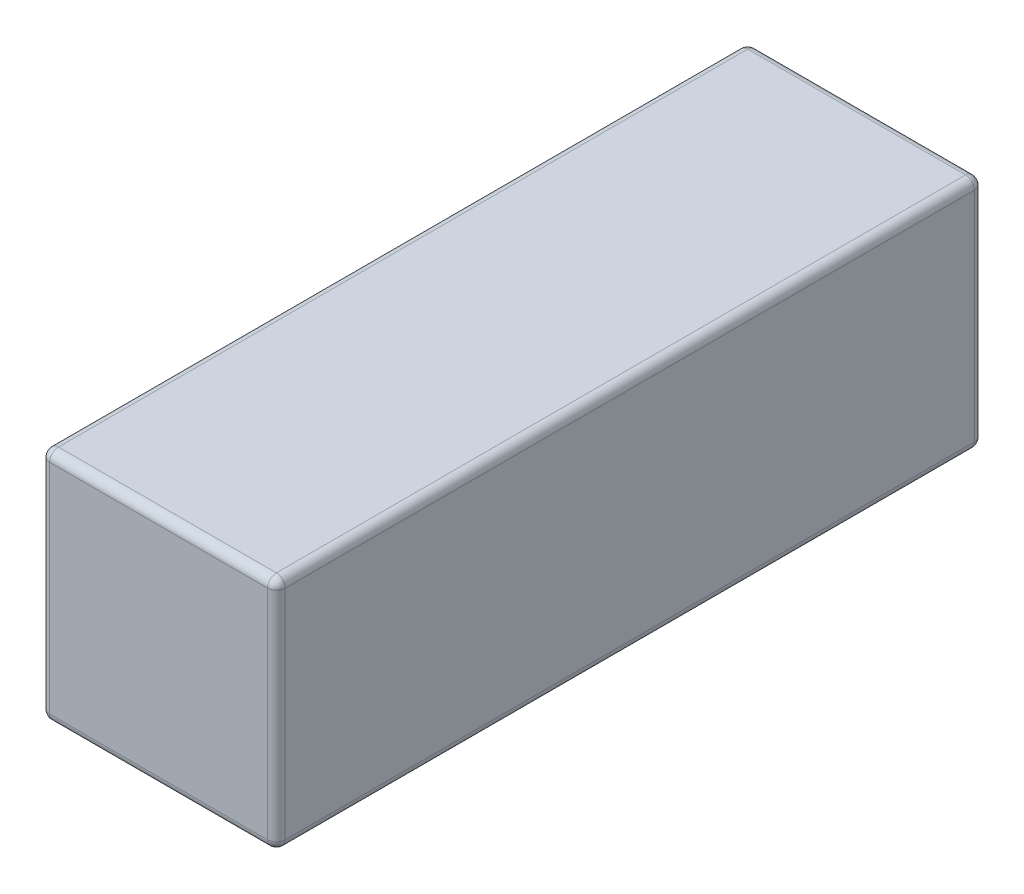
ISO-10303-21;
HEADER;
FILE_DESCRIPTION(('STEP AP214'),'2;1');
FILE_NAME('part.step','',(''),(''),'','','');
FILE_SCHEMA(('AUTOMOTIVE_DESIGN { 1 0 10303 214 1 1 1 1 }'));
ENDSEC;
DATA;
#1=APPLICATION_CONTEXT('core data for automotive mechanical design processes');
#2=APPLICATION_PROTOCOL_DEFINITION('international standard','automotive_design',2000,#1);
#3=PRODUCT_CONTEXT('',#1,'mechanical');
#4=PRODUCT('Part','Part','',(#3));
#5=PRODUCT_RELATED_PRODUCT_CATEGORY('part','',(#4));
#6=PRODUCT_DEFINITION_FORMATION('','',#4);
#7=PRODUCT_DEFINITION_CONTEXT('part definition',#1,'design');
#8=PRODUCT_DEFINITION('design','',#6,#7);
#9=PRODUCT_DEFINITION_SHAPE('','',#8);
#10=(LENGTH_UNIT() NAMED_UNIT(*) SI_UNIT(.MILLI.,.METRE.));
#11=(NAMED_UNIT(*) PLANE_ANGLE_UNIT() SI_UNIT($,.RADIAN.));
#12=(NAMED_UNIT(*) SI_UNIT($,.STERADIAN.) SOLID_ANGLE_UNIT());
#13=UNCERTAINTY_MEASURE_WITH_UNIT(LENGTH_MEASURE(1.E-05),#10,'distance_accuracy_value','');
#14=(GEOMETRIC_REPRESENTATION_CONTEXT(3) GLOBAL_UNCERTAINTY_ASSIGNED_CONTEXT((#13)) GLOBAL_UNIT_ASSIGNED_CONTEXT((#10,
#11,#12)) REPRESENTATION_CONTEXT('',''));
#15=CARTESIAN_POINT('',(0.,0.,0.));
#16=DIRECTION('',(0.,0.,1.));
#17=DIRECTION('',(1.,0.,0.));
#18=AXIS2_PLACEMENT_3D('',#15,#16,#17);
#19=CARTESIAN_POINT('',(2.,-2.,6.));
#20=DIRECTION('',(0.,1.,0.));
#21=DIRECTION('',(-1.,0.,0.));
#22=AXIS2_PLACEMENT_3D('',#19,#20,#21);
#23=PLANE('',#22);
#24=DIRECTION('',(1.,0.,0.));
#25=VECTOR('',#24,1.);
#26=CARTESIAN_POINT('',(2.,-2.,5.85));
#27=LINE('',#26,#25);
#28=CARTESIAN_POINT('',(1.85,-2.,5.85));
#29=VERTEX_POINT('',#28);
#30=CARTESIAN_POINT('',(-1.85,-2.,5.85));
#31=VERTEX_POINT('',#30);
#32=EDGE_CURVE('E133',#29,#31,#27,.F.);
#33=ORIENTED_EDGE('',*,*,#32,.T.);
#34=DIRECTION('',(0.,0.,-1.));
#35=VECTOR('',#34,1.);
#36=CARTESIAN_POINT('',(-1.85,-2.,6.));
#37=LINE('',#36,#35);
#38=CARTESIAN_POINT('',(-1.85,-2.,-5.85));
#39=VERTEX_POINT('',#38);
#40=EDGE_CURVE('E169',#31,#39,#37,.T.);
#41=ORIENTED_EDGE('',*,*,#40,.T.);
#42=DIRECTION('',(1.,0.,0.));
#43=VECTOR('',#42,1.);
#44=CARTESIAN_POINT('',(2.,-2.,-5.85));
#45=LINE('',#44,#43);
#46=CARTESIAN_POINT('',(1.85,-2.,-5.85));
#47=VERTEX_POINT('',#46);
#48=EDGE_CURVE('E136',#39,#47,#45,.T.);
#49=ORIENTED_EDGE('',*,*,#48,.T.);
#50=DIRECTION('',(0.,0.,-1.));
#51=VECTOR('',#50,1.);
#52=CARTESIAN_POINT('',(1.85,-2.,6.));
#53=LINE('',#52,#51);
#54=EDGE_CURVE('E129',#47,#29,#53,.F.);
#55=ORIENTED_EDGE('',*,*,#54,.T.);
#56=EDGE_LOOP('',(#33,#41,#49,#55));
#57=FACE_BOUND('',#56,.T.);
#58=ADVANCED_FACE('F41',(#57),#23,.F.);
#59=CARTESIAN_POINT('',(2.,-2.,6.));
#60=DIRECTION('',(-1.,0.,0.));
#61=DIRECTION('',(0.,0.,1.));
#62=AXIS2_PLACEMENT_3D('',#59,#60,#61);
#63=PLANE('',#62);
#64=DIRECTION('',(0.,1.,0.));
#65=VECTOR('',#64,1.);
#66=CARTESIAN_POINT('',(2.,2.,-5.85));
#67=LINE('',#66,#65);
#68=CARTESIAN_POINT('',(2.,-1.85,-5.85));
#69=VERTEX_POINT('',#68);
#70=CARTESIAN_POINT('',(2.,1.85,-5.85));
#71=VERTEX_POINT('',#70);
#72=EDGE_CURVE('E201',#69,#71,#67,.T.);
#73=ORIENTED_EDGE('',*,*,#72,.T.);
#74=DIRECTION('',(0.,0.,-1.));
#75=VECTOR('',#74,1.);
#76=CARTESIAN_POINT('',(2.,1.85,6.));
#77=LINE('',#76,#75);
#78=CARTESIAN_POINT('',(2.,1.85,5.85));
#79=VERTEX_POINT('',#78);
#80=EDGE_CURVE('E203',#71,#79,#77,.F.);
#81=ORIENTED_EDGE('',*,*,#80,.T.);
#82=DIRECTION('',(0.,1.,0.));
#83=VECTOR('',#82,1.);
#84=CARTESIAN_POINT('',(2.,-2.,5.85));
#85=LINE('',#84,#83);
#86=CARTESIAN_POINT('',(2.,-1.85,5.85));
#87=VERTEX_POINT('',#86);
#88=EDGE_CURVE('E198',#79,#87,#85,.F.);
#89=ORIENTED_EDGE('',*,*,#88,.T.);
#90=DIRECTION('',(0.,0.,-1.));
#91=VECTOR('',#90,1.);
#92=CARTESIAN_POINT('',(2.,-1.85,6.));
#93=LINE('',#92,#91);
#94=EDGE_CURVE('E146',#87,#69,#93,.T.);
#95=ORIENTED_EDGE('',*,*,#94,.T.);
#96=EDGE_LOOP('',(#73,#81,#89,#95));
#97=FACE_BOUND('',#96,.T.);
#98=ADVANCED_FACE('F302',(#97),#63,.F.);
#99=CARTESIAN_POINT('',(2.,2.,6.));
#100=DIRECTION('',(0.,-1.,0.));
#101=DIRECTION('',(1.,0.,0.));
#102=AXIS2_PLACEMENT_3D('',#99,#100,#101);
#103=PLANE('',#102);
#104=DIRECTION('',(-1.,0.,0.));
#105=VECTOR('',#104,1.);
#106=CARTESIAN_POINT('',(-2.,2.,-5.85));
#107=LINE('',#106,#105);
#108=CARTESIAN_POINT('',(1.85,2.,-5.85));
#109=VERTEX_POINT('',#108);
#110=CARTESIAN_POINT('',(-1.85,2.,-5.85));
#111=VERTEX_POINT('',#110);
#112=EDGE_CURVE('E193',#109,#111,#107,.T.);
#113=ORIENTED_EDGE('',*,*,#112,.T.);
#114=DIRECTION('',(0.,0.,-1.));
#115=VECTOR('',#114,1.);
#116=CARTESIAN_POINT('',(-1.85,2.,6.));
#117=LINE('',#116,#115);
#118=CARTESIAN_POINT('',(-1.85,2.,5.85));
#119=VERTEX_POINT('',#118);
#120=EDGE_CURVE('E195',#111,#119,#117,.F.);
#121=ORIENTED_EDGE('',*,*,#120,.T.);
#122=DIRECTION('',(-1.,0.,0.));
#123=VECTOR('',#122,1.);
#124=CARTESIAN_POINT('',(2.,2.,5.85));
#125=LINE('',#124,#123);
#126=CARTESIAN_POINT('',(1.85,2.,5.85));
#127=VERTEX_POINT('',#126);
#128=EDGE_CURVE('E189',#119,#127,#125,.F.);
#129=ORIENTED_EDGE('',*,*,#128,.T.);
#130=DIRECTION('',(0.,0.,-1.));
#131=VECTOR('',#130,1.);
#132=CARTESIAN_POINT('',(1.85,2.,6.));
#133=LINE('',#132,#131);
#134=EDGE_CURVE('E191',#127,#109,#133,.T.);
#135=ORIENTED_EDGE('',*,*,#134,.T.);
#136=EDGE_LOOP('',(#113,#121,#129,#135));
#137=FACE_BOUND('',#136,.T.);
#138=ADVANCED_FACE('F282',(#137),#103,.F.);
#139=CARTESIAN_POINT('',(-2.,-2.,6.));
#140=DIRECTION('',(1.,0.,0.));
#141=DIRECTION('',(0.,0.,-1.));
#142=AXIS2_PLACEMENT_3D('',#139,#140,#141);
#143=PLANE('',#142);
#144=DIRECTION('',(0.,-1.,0.));
#145=VECTOR('',#144,1.);
#146=CARTESIAN_POINT('',(-2.,-2.,-5.85));
#147=LINE('',#146,#145);
#148=CARTESIAN_POINT('',(-2.,1.85,-5.85));
#149=VERTEX_POINT('',#148);
#150=CARTESIAN_POINT('',(-2.,-1.85,-5.85));
#151=VERTEX_POINT('',#150);
#152=EDGE_CURVE('E175',#149,#151,#147,.T.);
#153=ORIENTED_EDGE('',*,*,#152,.T.);
#154=DIRECTION('',(0.,0.,-1.));
#155=VECTOR('',#154,1.);
#156=CARTESIAN_POINT('',(-2.,-1.85,6.));
#157=LINE('',#156,#155);
#158=CARTESIAN_POINT('',(-2.,-1.85,5.85));
#159=VERTEX_POINT('',#158);
#160=EDGE_CURVE('E177',#151,#159,#157,.F.);
#161=ORIENTED_EDGE('',*,*,#160,.T.);
#162=DIRECTION('',(0.,-1.,0.));
#163=VECTOR('',#162,1.);
#164=CARTESIAN_POINT('',(-2.,-2.,5.85));
#165=LINE('',#164,#163);
#166=CARTESIAN_POINT('',(-2.,1.85,5.85));
#167=VERTEX_POINT('',#166);
#168=EDGE_CURVE('E171',#159,#167,#165,.F.);
#169=ORIENTED_EDGE('',*,*,#168,.T.);
#170=DIRECTION('',(0.,0.,-1.));
#171=VECTOR('',#170,1.);
#172=CARTESIAN_POINT('',(-2.,1.85,6.));
#173=LINE('',#172,#171);
#174=EDGE_CURVE('E173',#167,#149,#173,.T.);
#175=ORIENTED_EDGE('',*,*,#174,.T.);
#176=EDGE_LOOP('',(#153,#161,#169,#175));
#177=FACE_BOUND('',#176,.T.);
#178=ADVANCED_FACE('F309',(#177),#143,.F.);
#179=CARTESIAN_POINT('',(0.,0.,6.));
#180=DIRECTION('',(0.,0.,-1.));
#181=DIRECTION('',(-1.,0.,0.));
#182=AXIS2_PLACEMENT_3D('',#179,#180,#181);
#183=PLANE('',#182);
#184=DIRECTION('',(-1.,0.,0.));
#185=VECTOR('',#184,1.);
#186=CARTESIAN_POINT('',(0.,1.85,6.));
#187=LINE('',#186,#185);
#188=CARTESIAN_POINT('',(1.85,1.85,6.));
#189=VERTEX_POINT('',#188);
#190=CARTESIAN_POINT('',(-1.85,1.85,6.));
#191=VERTEX_POINT('',#190);
#192=EDGE_CURVE('E50',#189,#191,#187,.T.);
#193=ORIENTED_EDGE('',*,*,#192,.T.);
#194=DIRECTION('',(0.,-1.,0.));
#195=VECTOR('',#194,1.);
#196=CARTESIAN_POINT('',(-1.85,0.,6.));
#197=LINE('',#196,#195);
#198=CARTESIAN_POINT('',(-1.85,-1.85,6.));
#199=VERTEX_POINT('',#198);
#200=EDGE_CURVE('E11',#191,#199,#197,.T.);
#201=ORIENTED_EDGE('',*,*,#200,.T.);
#202=DIRECTION('',(1.,0.,0.));
#203=VECTOR('',#202,1.);
#204=CARTESIAN_POINT('',(0.,-1.85,6.));
#205=LINE('',#204,#203);
#206=CARTESIAN_POINT('',(1.85,-1.85,6.));
#207=VERTEX_POINT('',#206);
#208=EDGE_CURVE('E206',#199,#207,#205,.T.);
#209=ORIENTED_EDGE('',*,*,#208,.T.);
#210=DIRECTION('',(0.,1.,0.));
#211=VECTOR('',#210,1.);
#212=CARTESIAN_POINT('',(1.85,0.,6.));
#213=LINE('',#212,#211);
#214=EDGE_CURVE('E61',#207,#189,#213,.T.);
#215=ORIENTED_EDGE('',*,*,#214,.T.);
#216=EDGE_LOOP('',(#193,#201,#209,#215));
#217=FACE_BOUND('',#216,.T.);
#218=ADVANCED_FACE('F373',(#217),#183,.F.);
#219=CARTESIAN_POINT('',(0.,0.,-6.));
#220=DIRECTION('',(0.,0.,-1.));
#221=DIRECTION('',(-1.,0.,0.));
#222=AXIS2_PLACEMENT_3D('',#219,#220,#221);
#223=PLANE('',#222);
#224=DIRECTION('',(1.,0.,0.));
#225=VECTOR('',#224,1.);
#226=CARTESIAN_POINT('',(-2.,-1.85,-6.));
#227=LINE('',#226,#225);
#228=CARTESIAN_POINT('',(1.85,-1.85,-6.));
#229=VERTEX_POINT('',#228);
#230=CARTESIAN_POINT('',(-1.85,-1.85,-6.));
#231=VERTEX_POINT('',#230);
#232=EDGE_CURVE('E184',#229,#231,#227,.F.);
#233=ORIENTED_EDGE('',*,*,#232,.T.);
#234=DIRECTION('',(0.,-1.,0.));
#235=VECTOR('',#234,1.);
#236=CARTESIAN_POINT('',(-1.85,2.,-6.));
#237=LINE('',#236,#235);
#238=CARTESIAN_POINT('',(-1.85,1.85,-6.));
#239=VERTEX_POINT('',#238);
#240=EDGE_CURVE('E186',#231,#239,#237,.F.);
#241=ORIENTED_EDGE('',*,*,#240,.T.);
#242=DIRECTION('',(-1.,0.,0.));
#243=VECTOR('',#242,1.);
#244=CARTESIAN_POINT('',(2.,1.85,-6.));
#245=LINE('',#244,#243);
#246=CARTESIAN_POINT('',(1.85,1.85,-6.));
#247=VERTEX_POINT('',#246);
#248=EDGE_CURVE('E182',#239,#247,#245,.F.);
#249=ORIENTED_EDGE('',*,*,#248,.T.);
#250=DIRECTION('',(0.,1.,0.));
#251=VECTOR('',#250,1.);
#252=CARTESIAN_POINT('',(1.85,-2.,-6.));
#253=LINE('',#252,#251);
#254=EDGE_CURVE('E180',#247,#229,#253,.F.);
#255=ORIENTED_EDGE('',*,*,#254,.T.);
#256=EDGE_LOOP('',(#233,#241,#249,#255));
#257=FACE_BOUND('',#256,.T.);
#258=ADVANCED_FACE('F273',(#257),#223,.T.);
#259=CARTESIAN_POINT('',(1.85,1.85,6.));
#260=DIRECTION('',(0.,0.,-1.));
#261=DIRECTION('',(-1.,0.,0.));
#262=AXIS2_PLACEMENT_3D('',#259,#260,#261);
#263=CYLINDRICAL_SURFACE('',#262,0.15);
#264=CARTESIAN_POINT('',(1.85,1.85,5.85));
#265=DIRECTION('',(0.,0.,1.));
#266=DIRECTION('',(1.,0.,0.));
#267=AXIS2_PLACEMENT_3D('',#264,#265,#266);
#268=CIRCLE('',#267,0.15);
#269=EDGE_CURVE('E45',#79,#127,#268,.T.);
#270=ORIENTED_EDGE('',*,*,#269,.F.);
#271=ORIENTED_EDGE('',*,*,#80,.F.);
#272=CARTESIAN_POINT('',(1.85,1.85,-5.85));
#273=DIRECTION('',(0.,0.,-1.));
#274=DIRECTION('',(-1.,0.,0.));
#275=AXIS2_PLACEMENT_3D('',#272,#273,#274);
#276=CIRCLE('',#275,0.15);
#277=EDGE_CURVE('E166',#109,#71,#276,.T.);
#278=ORIENTED_EDGE('',*,*,#277,.F.);
#279=ORIENTED_EDGE('',*,*,#134,.F.);
#280=EDGE_LOOP('',(#270,#271,#278,#279));
#281=FACE_BOUND('',#280,.T.);
#282=ADVANCED_FACE('F43',(#281),#263,.T.);
#283=CARTESIAN_POINT('',(1.85,1.85,5.85));
#284=DIRECTION('',(0.,0.,1.));
#285=DIRECTION('',(1.,0.,0.));
#286=AXIS2_PLACEMENT_3D('',#283,#284,#285);
#287=SPHERICAL_SURFACE('',#286,0.15);
#288=CARTESIAN_POINT('',(1.85,1.85,5.85));
#289=DIRECTION('',(0.,1.,0.));
#290=DIRECTION('',(0.,0.,1.));
#291=AXIS2_PLACEMENT_3D('',#288,#289,#290);
#292=CIRCLE('',#291,0.15);
#293=EDGE_CURVE('E252',#79,#189,#292,.F.);
#294=ORIENTED_EDGE('',*,*,#293,.F.);
#295=ORIENTED_EDGE('',*,*,#269,.T.);
#296=CARTESIAN_POINT('',(1.85,1.85,5.85));
#297=DIRECTION('',(1.,0.,0.));
#298=DIRECTION('',(0.,0.,-1.));
#299=AXIS2_PLACEMENT_3D('',#296,#297,#298);
#300=CIRCLE('',#299,0.15);
#301=EDGE_CURVE('E254',#189,#127,#300,.F.);
#302=ORIENTED_EDGE('',*,*,#301,.F.);
#303=EDGE_LOOP('',(#294,#295,#302));
#304=FACE_BOUND('',#303,.T.);
#305=ADVANCED_FACE('F298',(#304),#287,.T.);
#306=CARTESIAN_POINT('',(1.85,1.85,-5.85));
#307=DIRECTION('',(0.,0.,1.));
#308=DIRECTION('',(1.,0.,0.));
#309=AXIS2_PLACEMENT_3D('',#306,#307,#308);
#310=SPHERICAL_SURFACE('',#309,0.15);
#311=CARTESIAN_POINT('',(1.85,1.85,-5.85));
#312=DIRECTION('',(1.,0.,0.));
#313=DIRECTION('',(0.,0.,-1.));
#314=AXIS2_PLACEMENT_3D('',#311,#312,#313);
#315=CIRCLE('',#314,0.15);
#316=EDGE_CURVE('E246',#109,#247,#315,.F.);
#317=ORIENTED_EDGE('',*,*,#316,.F.);
#318=ORIENTED_EDGE('',*,*,#277,.T.);
#319=CARTESIAN_POINT('',(1.85,1.85,-5.85));
#320=DIRECTION('',(0.,1.,0.));
#321=DIRECTION('',(0.,0.,1.));
#322=AXIS2_PLACEMENT_3D('',#319,#320,#321);
#323=CIRCLE('',#322,0.15);
#324=EDGE_CURVE('E249',#247,#71,#323,.F.);
#325=ORIENTED_EDGE('',*,*,#324,.F.);
#326=EDGE_LOOP('',(#317,#318,#325));
#327=FACE_BOUND('',#326,.T.);
#328=ADVANCED_FACE('F261',(#327),#310,.T.);
#329=CARTESIAN_POINT('',(0.,1.85,5.85));
#330=DIRECTION('',(-1.,0.,0.));
#331=DIRECTION('',(0.,-1.,0.));
#332=AXIS2_PLACEMENT_3D('',#329,#330,#331);
#333=CYLINDRICAL_SURFACE('',#332,0.15);
#334=ORIENTED_EDGE('',*,*,#301,.T.);
#335=ORIENTED_EDGE('',*,*,#128,.F.);
#336=CARTESIAN_POINT('',(-1.85,1.85,5.85));
#337=DIRECTION('',(-1.,0.,0.));
#338=DIRECTION('',(0.,0.,1.));
#339=AXIS2_PLACEMENT_3D('',#336,#337,#338);
#340=CIRCLE('',#339,0.15);
#341=EDGE_CURVE('E241',#191,#119,#340,.T.);
#342=ORIENTED_EDGE('',*,*,#341,.F.);
#343=ORIENTED_EDGE('',*,*,#192,.F.);
#344=EDGE_LOOP('',(#334,#335,#342,#343));
#345=FACE_BOUND('',#344,.T.);
#346=ADVANCED_FACE('F293',(#345),#333,.T.);
#347=CARTESIAN_POINT('',(1.85,0.,5.85));
#348=DIRECTION('',(0.,1.,0.));
#349=DIRECTION('',(0.,0.,1.));
#350=AXIS2_PLACEMENT_3D('',#347,#348,#349);
#351=CYLINDRICAL_SURFACE('',#350,0.15);
#352=ORIENTED_EDGE('',*,*,#293,.T.);
#353=ORIENTED_EDGE('',*,*,#214,.F.);
#354=CARTESIAN_POINT('',(1.85,-1.85,5.85));
#355=DIRECTION('',(0.,-1.,0.));
#356=DIRECTION('',(0.,0.,-1.));
#357=AXIS2_PLACEMENT_3D('',#354,#355,#356);
#358=CIRCLE('',#357,0.15);
#359=EDGE_CURVE('E150',#87,#207,#358,.T.);
#360=ORIENTED_EDGE('',*,*,#359,.F.);
#361=ORIENTED_EDGE('',*,*,#88,.F.);
#362=EDGE_LOOP('',(#352,#353,#360,#361));
#363=FACE_BOUND('',#362,.T.);
#364=ADVANCED_FACE('F300',(#363),#351,.T.);
#365=CARTESIAN_POINT('',(1.85,-1.85,6.));
#366=DIRECTION('',(0.,0.,-1.));
#367=DIRECTION('',(-1.,0.,0.));
#368=AXIS2_PLACEMENT_3D('',#365,#366,#367);
#369=CYLINDRICAL_SURFACE('',#368,0.15);
#370=CARTESIAN_POINT('',(1.85,-1.85,-5.85));
#371=DIRECTION('',(0.,0.,-1.));
#372=DIRECTION('',(-1.,0.,0.));
#373=AXIS2_PLACEMENT_3D('',#370,#371,#372);
#374=CIRCLE('',#373,0.15);
#375=EDGE_CURVE('E151',#69,#47,#374,.T.);
#376=ORIENTED_EDGE('',*,*,#375,.F.);
#377=ORIENTED_EDGE('',*,*,#94,.F.);
#378=CARTESIAN_POINT('',(1.85,-1.85,5.85));
#379=DIRECTION('',(0.,0.,1.));
#380=DIRECTION('',(1.,0.,0.));
#381=AXIS2_PLACEMENT_3D('',#378,#379,#380);
#382=CIRCLE('',#381,0.15);
#383=EDGE_CURVE('E143',#29,#87,#382,.T.);
#384=ORIENTED_EDGE('',*,*,#383,.F.);
#385=ORIENTED_EDGE('',*,*,#54,.F.);
#386=EDGE_LOOP('',(#376,#377,#384,#385));
#387=FACE_BOUND('',#386,.T.);
#388=ADVANCED_FACE('F145',(#387),#369,.T.);
#389=CARTESIAN_POINT('',(1.85,-2.,-5.85));
#390=DIRECTION('',(0.,-1.,0.));
#391=DIRECTION('',(0.,0.,-1.));
#392=AXIS2_PLACEMENT_3D('',#389,#390,#391);
#393=CYLINDRICAL_SURFACE('',#392,0.15);
#394=ORIENTED_EDGE('',*,*,#324,.T.);
#395=ORIENTED_EDGE('',*,*,#72,.F.);
#396=CARTESIAN_POINT('',(1.85,-1.85,-5.85));
#397=DIRECTION('',(0.,-1.,0.));
#398=DIRECTION('',(0.,0.,-1.));
#399=AXIS2_PLACEMENT_3D('',#396,#397,#398);
#400=CIRCLE('',#399,0.15);
#401=EDGE_CURVE('E236',#229,#69,#400,.T.);
#402=ORIENTED_EDGE('',*,*,#401,.F.);
#403=ORIENTED_EDGE('',*,*,#254,.F.);
#404=EDGE_LOOP('',(#394,#395,#402,#403));
#405=FACE_BOUND('',#404,.T.);
#406=ADVANCED_FACE('F269',(#405),#393,.T.);
#407=CARTESIAN_POINT('',(2.,1.85,-5.85));
#408=DIRECTION('',(1.,0.,0.));
#409=DIRECTION('',(0.,1.,0.));
#410=AXIS2_PLACEMENT_3D('',#407,#408,#409);
#411=CYLINDRICAL_SURFACE('',#410,0.15);
#412=ORIENTED_EDGE('',*,*,#316,.T.);
#413=ORIENTED_EDGE('',*,*,#248,.F.);
#414=CARTESIAN_POINT('',(-1.85,1.85,-5.85));
#415=DIRECTION('',(-1.,0.,0.));
#416=DIRECTION('',(0.,0.,1.));
#417=AXIS2_PLACEMENT_3D('',#414,#415,#416);
#418=CIRCLE('',#417,0.15);
#419=EDGE_CURVE('E233',#111,#239,#418,.T.);
#420=ORIENTED_EDGE('',*,*,#419,.F.);
#421=ORIENTED_EDGE('',*,*,#112,.F.);
#422=EDGE_LOOP('',(#412,#413,#420,#421));
#423=FACE_BOUND('',#422,.T.);
#424=ADVANCED_FACE('F279',(#423),#411,.T.);
#425=CARTESIAN_POINT('',(-1.85,1.85,6.));
#426=DIRECTION('',(0.,0.,-1.));
#427=DIRECTION('',(-1.,0.,0.));
#428=AXIS2_PLACEMENT_3D('',#425,#426,#427);
#429=CYLINDRICAL_SURFACE('',#428,0.15);
#430=CARTESIAN_POINT('',(-1.85,1.85,5.85));
#431=DIRECTION('',(0.,0.,1.));
#432=DIRECTION('',(1.,0.,0.));
#433=AXIS2_PLACEMENT_3D('',#430,#431,#432);
#434=CIRCLE('',#433,0.15);
#435=EDGE_CURVE('E243',#119,#167,#434,.T.);
#436=ORIENTED_EDGE('',*,*,#435,.F.);
#437=ORIENTED_EDGE('',*,*,#120,.F.);
#438=CARTESIAN_POINT('',(-1.85,1.85,-5.85));
#439=DIRECTION('',(0.,0.,-1.));
#440=DIRECTION('',(-1.,0.,0.));
#441=AXIS2_PLACEMENT_3D('',#438,#439,#440);
#442=CIRCLE('',#441,0.15);
#443=EDGE_CURVE('E230',#149,#111,#442,.T.);
#444=ORIENTED_EDGE('',*,*,#443,.F.);
#445=ORIENTED_EDGE('',*,*,#174,.F.);
#446=EDGE_LOOP('',(#436,#437,#444,#445));
#447=FACE_BOUND('',#446,.T.);
#448=ADVANCED_FACE('F286',(#447),#429,.T.);
#449=CARTESIAN_POINT('',(-1.85,1.85,5.85));
#450=DIRECTION('',(0.,0.,1.));
#451=DIRECTION('',(1.,0.,0.));
#452=AXIS2_PLACEMENT_3D('',#449,#450,#451);
#453=SPHERICAL_SURFACE('',#452,0.15);
#454=ORIENTED_EDGE('',*,*,#341,.T.);
#455=ORIENTED_EDGE('',*,*,#435,.T.);
#456=CARTESIAN_POINT('',(-1.85,1.85,5.85));
#457=DIRECTION('',(0.,1.,0.));
#458=DIRECTION('',(0.,0.,1.));
#459=AXIS2_PLACEMENT_3D('',#456,#457,#458);
#460=CIRCLE('',#459,0.15);
#461=EDGE_CURVE('E158',#191,#167,#460,.F.);
#462=ORIENTED_EDGE('',*,*,#461,.F.);
#463=EDGE_LOOP('',(#454,#455,#462));
#464=FACE_BOUND('',#463,.T.);
#465=ADVANCED_FACE('F350',(#464),#453,.T.);
#466=CARTESIAN_POINT('',(1.85,-1.85,5.85));
#467=DIRECTION('',(0.,0.,1.));
#468=DIRECTION('',(1.,0.,0.));
#469=AXIS2_PLACEMENT_3D('',#466,#467,#468);
#470=SPHERICAL_SURFACE('',#469,0.15);
#471=ORIENTED_EDGE('',*,*,#383,.T.);
#472=ORIENTED_EDGE('',*,*,#359,.T.);
#473=CARTESIAN_POINT('',(1.85,-1.85,5.85));
#474=DIRECTION('',(1.,0.,0.));
#475=DIRECTION('',(0.,0.,-1.));
#476=AXIS2_PLACEMENT_3D('',#473,#474,#475);
#477=CIRCLE('',#476,0.15);
#478=EDGE_CURVE('E154',#29,#207,#477,.F.);
#479=ORIENTED_EDGE('',*,*,#478,.F.);
#480=EDGE_LOOP('',(#471,#472,#479));
#481=FACE_BOUND('',#480,.T.);
#482=ADVANCED_FACE('F155',(#481),#470,.T.);
#483=CARTESIAN_POINT('',(1.85,-1.85,-5.85));
#484=DIRECTION('',(0.,0.,1.));
#485=DIRECTION('',(1.,0.,0.));
#486=AXIS2_PLACEMENT_3D('',#483,#484,#485);
#487=SPHERICAL_SURFACE('',#486,0.15);
#488=ORIENTED_EDGE('',*,*,#401,.T.);
#489=ORIENTED_EDGE('',*,*,#375,.T.);
#490=CARTESIAN_POINT('',(1.85,-1.85,-5.85));
#491=DIRECTION('',(1.,0.,0.));
#492=DIRECTION('',(0.,0.,-1.));
#493=AXIS2_PLACEMENT_3D('',#490,#491,#492);
#494=CIRCLE('',#493,0.15);
#495=EDGE_CURVE('E159',#229,#47,#494,.F.);
#496=ORIENTED_EDGE('',*,*,#495,.F.);
#497=EDGE_LOOP('',(#488,#489,#496));
#498=FACE_BOUND('',#497,.T.);
#499=ADVANCED_FACE('F343',(#498),#487,.T.);
#500=CARTESIAN_POINT('',(-1.85,1.85,-5.85));
#501=DIRECTION('',(0.,0.,1.));
#502=DIRECTION('',(1.,0.,0.));
#503=AXIS2_PLACEMENT_3D('',#500,#501,#502);
#504=SPHERICAL_SURFACE('',#503,0.15);
#505=ORIENTED_EDGE('',*,*,#443,.T.);
#506=ORIENTED_EDGE('',*,*,#419,.T.);
#507=CARTESIAN_POINT('',(-1.85,1.85,-5.85));
#508=DIRECTION('',(0.,1.,0.));
#509=DIRECTION('',(0.,0.,1.));
#510=AXIS2_PLACEMENT_3D('',#507,#508,#509);
#511=CIRCLE('',#510,0.15);
#512=EDGE_CURVE('E224',#149,#239,#511,.F.);
#513=ORIENTED_EDGE('',*,*,#512,.F.);
#514=EDGE_LOOP('',(#505,#506,#513));
#515=FACE_BOUND('',#514,.T.);
#516=ADVANCED_FACE('F339',(#515),#504,.T.);
#517=CARTESIAN_POINT('',(-1.85,0.,5.85));
#518=DIRECTION('',(0.,-1.,0.));
#519=DIRECTION('',(0.,0.,-1.));
#520=AXIS2_PLACEMENT_3D('',#517,#518,#519);
#521=CYLINDRICAL_SURFACE('',#520,0.15);
#522=ORIENTED_EDGE('',*,*,#461,.T.);
#523=ORIENTED_EDGE('',*,*,#168,.F.);
#524=CARTESIAN_POINT('',(-1.85,-1.85,5.85));
#525=DIRECTION('',(0.,-1.,0.));
#526=DIRECTION('',(0.,0.,-1.));
#527=AXIS2_PLACEMENT_3D('',#524,#525,#526);
#528=CIRCLE('',#527,0.15);
#529=EDGE_CURVE('E221',#199,#159,#528,.T.);
#530=ORIENTED_EDGE('',*,*,#529,.F.);
#531=ORIENTED_EDGE('',*,*,#200,.F.);
#532=EDGE_LOOP('',(#522,#523,#530,#531));
#533=FACE_BOUND('',#532,.T.);
#534=ADVANCED_FACE('F336',(#533),#521,.T.);
#535=CARTESIAN_POINT('',(0.,-1.85,5.85));
#536=DIRECTION('',(1.,0.,0.));
#537=DIRECTION('',(0.,1.,0.));
#538=AXIS2_PLACEMENT_3D('',#535,#536,#537);
#539=CYLINDRICAL_SURFACE('',#538,0.15);
#540=ORIENTED_EDGE('',*,*,#478,.T.);
#541=ORIENTED_EDGE('',*,*,#208,.F.);
#542=CARTESIAN_POINT('',(-1.85,-1.85,5.85));
#543=DIRECTION('',(-1.,0.,0.));
#544=DIRECTION('',(0.,0.,1.));
#545=AXIS2_PLACEMENT_3D('',#542,#543,#544);
#546=CIRCLE('',#545,0.15);
#547=EDGE_CURVE('E162',#31,#199,#546,.T.);
#548=ORIENTED_EDGE('',*,*,#547,.F.);
#549=ORIENTED_EDGE('',*,*,#32,.F.);
#550=EDGE_LOOP('',(#540,#541,#548,#549));
#551=FACE_BOUND('',#550,.T.);
#552=ADVANCED_FACE('F161',(#551),#539,.T.);
#553=CARTESIAN_POINT('',(2.,-1.85,-5.85));
#554=DIRECTION('',(-1.,0.,0.));
#555=DIRECTION('',(0.,-1.,0.));
#556=AXIS2_PLACEMENT_3D('',#553,#554,#555);
#557=CYLINDRICAL_SURFACE('',#556,0.15);
#558=ORIENTED_EDGE('',*,*,#495,.T.);
#559=ORIENTED_EDGE('',*,*,#48,.F.);
#560=CARTESIAN_POINT('',(-1.85,-1.85,-5.85));
#561=DIRECTION('',(-1.,0.,0.));
#562=DIRECTION('',(0.,0.,1.));
#563=AXIS2_PLACEMENT_3D('',#560,#561,#562);
#564=CIRCLE('',#563,0.15);
#565=EDGE_CURVE('E217',#231,#39,#564,.T.);
#566=ORIENTED_EDGE('',*,*,#565,.F.);
#567=ORIENTED_EDGE('',*,*,#232,.F.);
#568=EDGE_LOOP('',(#558,#559,#566,#567));
#569=FACE_BOUND('',#568,.T.);
#570=ADVANCED_FACE('F329',(#569),#557,.T.);
#571=CARTESIAN_POINT('',(-1.85,-2.,-5.85));
#572=DIRECTION('',(0.,1.,0.));
#573=DIRECTION('',(0.,0.,1.));
#574=AXIS2_PLACEMENT_3D('',#571,#572,#573);
#575=CYLINDRICAL_SURFACE('',#574,0.15);
#576=ORIENTED_EDGE('',*,*,#512,.T.);
#577=ORIENTED_EDGE('',*,*,#240,.F.);
#578=CARTESIAN_POINT('',(-1.85,-1.85,-5.85));
#579=DIRECTION('',(0.,-1.,0.));
#580=DIRECTION('',(0.,0.,-1.));
#581=AXIS2_PLACEMENT_3D('',#578,#579,#580);
#582=CIRCLE('',#581,0.15);
#583=EDGE_CURVE('E214',#151,#231,#582,.T.);
#584=ORIENTED_EDGE('',*,*,#583,.F.);
#585=ORIENTED_EDGE('',*,*,#152,.F.);
#586=EDGE_LOOP('',(#576,#577,#584,#585));
#587=FACE_BOUND('',#586,.T.);
#588=ADVANCED_FACE('F325',(#587),#575,.T.);
#589=CARTESIAN_POINT('',(-1.85,-1.85,5.85));
#590=DIRECTION('',(0.,0.,1.));
#591=DIRECTION('',(1.,0.,0.));
#592=AXIS2_PLACEMENT_3D('',#589,#590,#591);
#593=SPHERICAL_SURFACE('',#592,0.15);
#594=ORIENTED_EDGE('',*,*,#547,.T.);
#595=ORIENTED_EDGE('',*,*,#529,.T.);
#596=CARTESIAN_POINT('',(-1.85,-1.85,5.85));
#597=DIRECTION('',(0.,0.,1.));
#598=DIRECTION('',(1.,0.,0.));
#599=AXIS2_PLACEMENT_3D('',#596,#597,#598);
#600=CIRCLE('',#599,0.15);
#601=EDGE_CURVE('E212',#31,#159,#600,.F.);
#602=ORIENTED_EDGE('',*,*,#601,.F.);
#603=EDGE_LOOP('',(#594,#595,#602));
#604=FACE_BOUND('',#603,.T.);
#605=ADVANCED_FACE('F321',(#604),#593,.T.);
#606=CARTESIAN_POINT('',(-1.85,-1.85,-5.85));
#607=DIRECTION('',(0.,0.,1.));
#608=DIRECTION('',(1.,0.,0.));
#609=AXIS2_PLACEMENT_3D('',#606,#607,#608);
#610=SPHERICAL_SURFACE('',#609,0.15);
#611=ORIENTED_EDGE('',*,*,#583,.T.);
#612=ORIENTED_EDGE('',*,*,#565,.T.);
#613=CARTESIAN_POINT('',(-1.85,-1.85,-5.85));
#614=DIRECTION('',(0.,0.,-1.));
#615=DIRECTION('',(-1.,0.,0.));
#616=AXIS2_PLACEMENT_3D('',#613,#614,#615);
#617=CIRCLE('',#616,0.15);
#618=EDGE_CURVE('E210',#151,#39,#617,.F.);
#619=ORIENTED_EDGE('',*,*,#618,.F.);
#620=EDGE_LOOP('',(#611,#612,#619));
#621=FACE_BOUND('',#620,.T.);
#622=ADVANCED_FACE('F317',(#621),#610,.T.);
#623=CARTESIAN_POINT('',(-1.85,-1.85,6.));
#624=DIRECTION('',(0.,0.,-1.));
#625=DIRECTION('',(-1.,0.,0.));
#626=AXIS2_PLACEMENT_3D('',#623,#624,#625);
#627=CYLINDRICAL_SURFACE('',#626,0.15);
#628=ORIENTED_EDGE('',*,*,#601,.T.);
#629=ORIENTED_EDGE('',*,*,#160,.F.);
#630=ORIENTED_EDGE('',*,*,#618,.T.);
#631=ORIENTED_EDGE('',*,*,#40,.F.);
#632=EDGE_LOOP('',(#628,#629,#630,#631));
#633=FACE_BOUND('',#632,.T.);
#634=ADVANCED_FACE('F314',(#633),#627,.T.);
#635=CLOSED_SHELL('',(#58,#98,#138,#178,#218,#258,#282,#305,#328,#346,#364,#388,#406,#424,#448,
#465,#482,#499,#516,#534,#552,#570,#588,#605,#622,#634));
#636=MANIFOLD_SOLID_BREP('B2',#635);
#637=ADVANCED_BREP_SHAPE_REPRESENTATION('',(#18,#636),#14);
#638=SHAPE_DEFINITION_REPRESENTATION(#9,#637);
ENDSEC;
END-ISO-10303-21;
